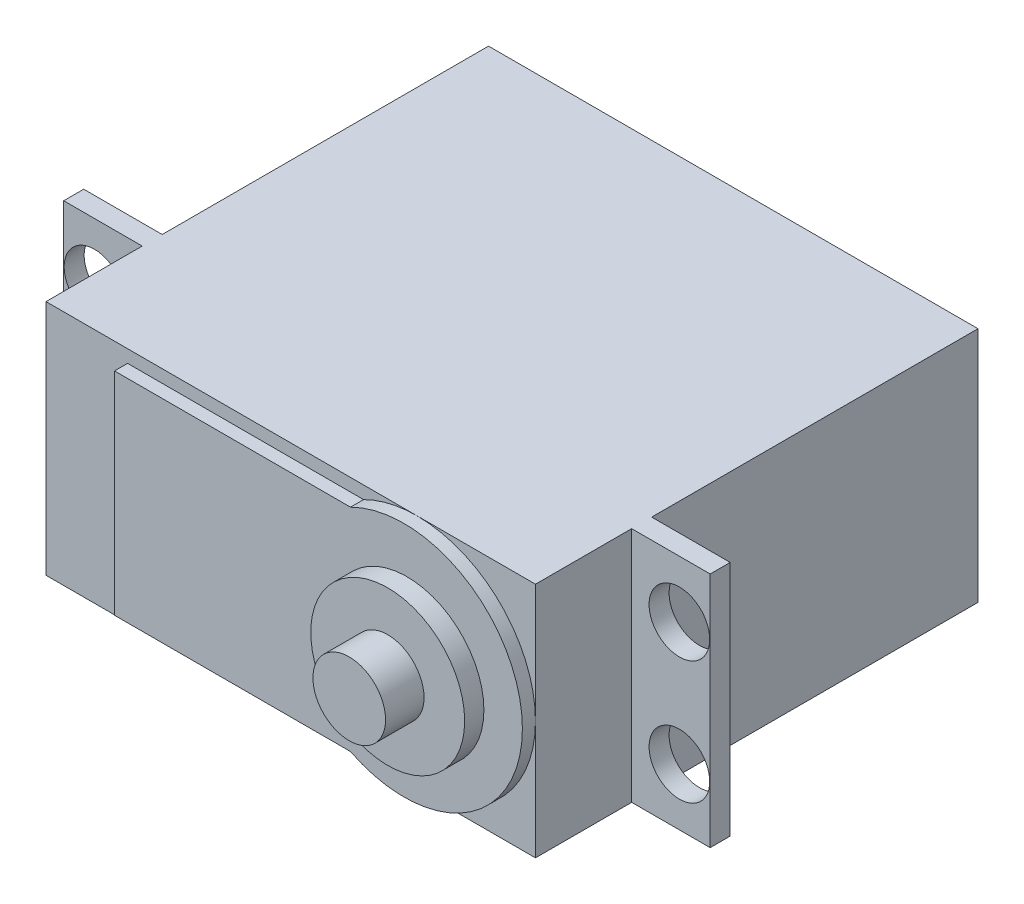
ISO-10303-21;
HEADER;
FILE_DESCRIPTION(('STEP AP214'),'2;1');
FILE_NAME('part.step','',(''),(''),'','','');
FILE_SCHEMA(('AUTOMOTIVE_DESIGN { 1 0 10303 214 1 1 1 1 }'));
ENDSEC;
DATA;
#1=APPLICATION_CONTEXT('core data for automotive mechanical design processes');
#2=APPLICATION_PROTOCOL_DEFINITION('international standard','automotive_design',2000,#1);
#3=PRODUCT_CONTEXT('',#1,'mechanical');
#4=PRODUCT('Part','Part','',(#3));
#5=PRODUCT_RELATED_PRODUCT_CATEGORY('part','',(#4));
#6=PRODUCT_DEFINITION_FORMATION('','',#4);
#7=PRODUCT_DEFINITION_CONTEXT('part definition',#1,'design');
#8=PRODUCT_DEFINITION('design','',#6,#7);
#9=PRODUCT_DEFINITION_SHAPE('','',#8);
#10=(LENGTH_UNIT() NAMED_UNIT(*) SI_UNIT(.MILLI.,.METRE.));
#11=(NAMED_UNIT(*) PLANE_ANGLE_UNIT() SI_UNIT($,.RADIAN.));
#12=(NAMED_UNIT(*) SI_UNIT($,.STERADIAN.) SOLID_ANGLE_UNIT());
#13=UNCERTAINTY_MEASURE_WITH_UNIT(LENGTH_MEASURE(1.E-05),#10,'distance_accuracy_value','');
#14=(GEOMETRIC_REPRESENTATION_CONTEXT(3) GLOBAL_UNCERTAINTY_ASSIGNED_CONTEXT((#13)) GLOBAL_UNIT_ASSIGNED_CONTEXT((#10,
#11,#12)) REPRESENTATION_CONTEXT('',''));
#15=CARTESIAN_POINT('',(0.,0.,0.));
#16=DIRECTION('',(0.,0.,1.));
#17=DIRECTION('',(1.,0.,0.));
#18=AXIS2_PLACEMENT_3D('',#15,#16,#17);
#19=CARTESIAN_POINT('',(0.,0.,36.5125));
#20=DIRECTION('',(0.,0.,1.));
#21=DIRECTION('',(1.,0.,0.));
#22=AXIS2_PLACEMENT_3D('',#19,#20,#21);
#23=PLANE('',#22);
#24=CARTESIAN_POINT('',(-43.1606186472595,-12.9670800765665,36.5125));
#25=DIRECTION('',(0.,0.,1.));
#26=DIRECTION('',(1.,0.,0.));
#27=AXIS2_PLACEMENT_3D('',#24,#25,#26);
#28=CIRCLE('',#27,9.779);
#29=CARTESIAN_POINT('',(-47.5644935816213,-21.6983300765665,36.5125));
#30=VERTEX_POINT('',#29);
#31=CARTESIAN_POINT('',(-43.1606186472595,-22.7460800765665,36.5125));
#32=VERTEX_POINT('',#31);
#33=EDGE_CURVE('E46',#30,#32,#28,.T.);
#34=ORIENTED_EDGE('',*,*,#33,.F.);
#35=DIRECTION('',(-1.,0.,0.));
#36=VECTOR('',#35,1.);
#37=CARTESIAN_POINT('',(0.,-21.6983300765665,36.5125));
#38=LINE('',#37,#36);
#39=CARTESIAN_POINT('',(-67.0366186472595,-21.6983300765665,36.5125));
#40=VERTEX_POINT('',#39);
#41=EDGE_CURVE('E53',#30,#40,#38,.T.);
#42=ORIENTED_EDGE('',*,*,#41,.T.);
#43=DIRECTION('',(0.,1.,0.));
#44=VECTOR('',#43,1.);
#45=CARTESIAN_POINT('',(-67.0366186472595,0.,36.5125));
#46=LINE('',#45,#44);
#47=CARTESIAN_POINT('',(-67.0366186472595,-4.23583007656654,36.5125));
#48=VERTEX_POINT('',#47);
#49=EDGE_CURVE('E58',#40,#48,#46,.T.);
#50=ORIENTED_EDGE('',*,*,#49,.T.);
#51=DIRECTION('',(-1.,0.,0.));
#52=VECTOR('',#51,1.);
#53=CARTESIAN_POINT('',(0.,-4.23583007656653,36.5125));
#54=LINE('',#53,#52);
#55=CARTESIAN_POINT('',(-47.5644935816213,-4.23583007656654,36.5125));
#56=VERTEX_POINT('',#55);
#57=EDGE_CURVE('E183',#56,#48,#54,.T.);
#58=ORIENTED_EDGE('',*,*,#57,.F.);
#59=CARTESIAN_POINT('',(-43.1606186472595,-3.18808007656653,36.5125));
#60=VERTEX_POINT('',#59);
#61=EDGE_CURVE('E194',#60,#56,#28,.T.);
#62=ORIENTED_EDGE('',*,*,#61,.F.);
#63=DIRECTION('',(-1.,0.,0.));
#64=VECTOR('',#63,1.);
#65=CARTESIAN_POINT('',(-73.7676186472595,-3.18808007656653,36.5125));
#66=LINE('',#65,#64);
#67=CARTESIAN_POINT('',(-73.7676186472595,-3.18808007656653,36.5125));
#68=VERTEX_POINT('',#67);
#69=EDGE_CURVE('E213',#60,#68,#66,.T.);
#70=ORIENTED_EDGE('',*,*,#69,.T.);
#71=DIRECTION('',(0.,-1.,0.));
#72=VECTOR('',#71,1.);
#73=CARTESIAN_POINT('',(-73.7676186472595,-3.18808007656653,36.5125));
#74=LINE('',#73,#72);
#75=CARTESIAN_POINT('',(-73.7676186472595,-22.7460800765665,36.5125));
#76=VERTEX_POINT('',#75);
#77=EDGE_CURVE('E201',#68,#76,#74,.T.);
#78=ORIENTED_EDGE('',*,*,#77,.T.);
#79=DIRECTION('',(1.,0.,0.));
#80=VECTOR('',#79,1.);
#81=CARTESIAN_POINT('',(-73.7676186472595,-22.7460800765665,36.5125));
#82=LINE('',#81,#80);
#83=EDGE_CURVE('E206',#76,#32,#82,.T.);
#84=ORIENTED_EDGE('',*,*,#83,.T.);
#85=EDGE_LOOP('',(#34,#42,#50,#58,#62,#70,#78,#84));
#86=FACE_BOUND('',#85,.T.);
#87=ADVANCED_FACE('F35',(#86),#23,.T.);
#88=CARTESIAN_POINT('',(-33.3816186472595,-12.9670800765665,36.5125));
#89=VERTEX_POINT('',#88);
#90=EDGE_CURVE('E11',#32,#89,#28,.T.);
#91=ORIENTED_EDGE('',*,*,#90,.F.);
#92=CARTESIAN_POINT('',(-33.3816186472595,-22.7460800765665,36.5125));
#93=VERTEX_POINT('',#92);
#94=EDGE_CURVE('E204',#32,#93,#82,.T.);
#95=ORIENTED_EDGE('',*,*,#94,.T.);
#96=DIRECTION('',(0.,1.,0.));
#97=VECTOR('',#96,1.);
#98=CARTESIAN_POINT('',(-33.3816186472595,-3.18808007656653,36.5125));
#99=LINE('',#98,#97);
#100=EDGE_CURVE('E210',#93,#89,#99,.T.);
#101=ORIENTED_EDGE('',*,*,#100,.T.);
#102=EDGE_LOOP('',(#91,#95,#101));
#103=FACE_BOUND('',#102,.T.);
#104=ADVANCED_FACE('F408',(#103),#23,.T.);
#105=CARTESIAN_POINT('',(0.,0.,28.575));
#106=DIRECTION('',(0.,0.,1.));
#107=DIRECTION('',(1.,0.,0.));
#108=AXIS2_PLACEMENT_3D('',#105,#106,#107);
#109=PLANE('',#108);
#110=DIRECTION('',(0.,-1.,0.));
#111=VECTOR('',#110,1.);
#112=CARTESIAN_POINT('',(-73.7676186472595,-3.18808007656653,28.575));
#113=LINE('',#112,#111);
#114=CARTESIAN_POINT('',(-73.7676186472595,-3.18808007656653,28.575));
#115=VERTEX_POINT('',#114);
#116=CARTESIAN_POINT('',(-73.7676186472595,-22.7460800765665,28.575));
#117=VERTEX_POINT('',#116);
#118=EDGE_CURVE('E167',#115,#117,#113,.T.);
#119=ORIENTED_EDGE('',*,*,#118,.F.);
#120=DIRECTION('',(-1.,0.,0.));
#121=VECTOR('',#120,1.);
#122=CARTESIAN_POINT('',(-80.2446186472595,-3.18808007656653,28.575));
#123=LINE('',#122,#121);
#124=CARTESIAN_POINT('',(-80.2446186472595,-3.18808007656653,28.575));
#125=VERTEX_POINT('',#124);
#126=EDGE_CURVE('E390',#115,#125,#123,.T.);
#127=ORIENTED_EDGE('',*,*,#126,.T.);
#128=DIRECTION('',(0.,-1.,0.));
#129=VECTOR('',#128,1.);
#130=CARTESIAN_POINT('',(-80.2446186472595,-3.18808007656653,28.575));
#131=LINE('',#130,#129);
#132=CARTESIAN_POINT('',(-80.2446186472595,-22.7460800765665,28.575));
#133=VERTEX_POINT('',#132);
#134=EDGE_CURVE('E278',#125,#133,#131,.T.);
#135=ORIENTED_EDGE('',*,*,#134,.T.);
#136=DIRECTION('',(1.,0.,0.));
#137=VECTOR('',#136,1.);
#138=CARTESIAN_POINT('',(-80.2446186472595,-22.7460800765665,28.575));
#139=LINE('',#138,#137);
#140=EDGE_CURVE('E291',#133,#117,#139,.T.);
#141=ORIENTED_EDGE('',*,*,#140,.T.);
#142=EDGE_LOOP('',(#119,#127,#135,#141));
#143=FACE_BOUND('',#142,.T.);
#144=CARTESIAN_POINT('',(-77.7046186472595,-7.88708007656653,28.575));
#145=DIRECTION('',(0.,0.,1.));
#146=DIRECTION('',(1.,0.,0.));
#147=AXIS2_PLACEMENT_3D('',#144,#145,#146);
#148=CIRCLE('',#147,2.50190000000001);
#149=CARTESIAN_POINT('',(-75.2027186472595,-7.88708007656653,28.575));
#150=VERTEX_POINT('',#149);
#151=EDGE_CURVE('E271',#150,#150,#148,.T.);
#152=ORIENTED_EDGE('',*,*,#151,.F.);
#153=EDGE_LOOP('',(#152));
#154=FACE_BOUND('',#153,.T.);
#155=CARTESIAN_POINT('',(-77.7046186472594,-18.0470800765665,28.575));
#156=DIRECTION('',(0.,0.,1.));
#157=DIRECTION('',(1.,0.,0.));
#158=AXIS2_PLACEMENT_3D('',#155,#156,#157);
#159=CIRCLE('',#158,2.5019);
#160=CARTESIAN_POINT('',(-75.2027186472594,-18.0470800765665,28.575));
#161=VERTEX_POINT('',#160);
#162=EDGE_CURVE('E249',#161,#161,#159,.T.);
#163=ORIENTED_EDGE('',*,*,#162,.F.);
#164=EDGE_LOOP('',(#163));
#165=FACE_BOUND('',#164,.T.);
#166=ADVANCED_FACE('F412',(#143,#154,#165),#109,.T.);
#167=CARTESIAN_POINT('',(-73.7676186472595,-3.18808007656653,26.924));
#168=DIRECTION('',(1.,0.,0.));
#169=DIRECTION('',(0.,0.,-1.));
#170=AXIS2_PLACEMENT_3D('',#167,#168,#169);
#171=PLANE('',#170);
#172=DIRECTION('',(0.,-1.,0.));
#173=VECTOR('',#172,1.);
#174=CARTESIAN_POINT('',(-73.7676186472595,-3.18808007656653,0.));
#175=LINE('',#174,#173);
#176=CARTESIAN_POINT('',(-73.7676186472595,-3.18808007656653,0.));
#177=VERTEX_POINT('',#176);
#178=CARTESIAN_POINT('',(-73.7676186472595,-22.7460800765665,0.));
#179=VERTEX_POINT('',#178);
#180=EDGE_CURVE('E321',#177,#179,#175,.T.);
#181=ORIENTED_EDGE('',*,*,#180,.T.);
#182=DIRECTION('',(0.,0.,-1.));
#183=VECTOR('',#182,1.);
#184=CARTESIAN_POINT('',(-73.7676186472595,-22.7460800765665,26.924));
#185=LINE('',#184,#183);
#186=CARTESIAN_POINT('',(-73.7676186472595,-22.7460800765665,26.924));
#187=VERTEX_POINT('',#186);
#188=EDGE_CURVE('E302',#187,#179,#185,.T.);
#189=ORIENTED_EDGE('',*,*,#188,.F.);
#190=DIRECTION('',(0.,-1.,0.));
#191=VECTOR('',#190,1.);
#192=CARTESIAN_POINT('',(-73.7676186472595,-3.18808007656653,26.924));
#193=LINE('',#192,#191);
#194=CARTESIAN_POINT('',(-73.7676186472595,-3.18808007656653,26.924));
#195=VERTEX_POINT('',#194);
#196=EDGE_CURVE('E306',#195,#187,#193,.T.);
#197=ORIENTED_EDGE('',*,*,#196,.F.);
#198=DIRECTION('',(0.,0.,-1.));
#199=VECTOR('',#198,1.);
#200=CARTESIAN_POINT('',(-73.7676186472595,-3.18808007656653,26.924));
#201=LINE('',#200,#199);
#202=EDGE_CURVE('E295',#195,#177,#201,.T.);
#203=ORIENTED_EDGE('',*,*,#202,.T.);
#204=EDGE_LOOP('',(#181,#189,#197,#203));
#205=FACE_BOUND('',#204,.T.);
#206=ADVANCED_FACE('F37',(#205),#171,.F.);
#207=CARTESIAN_POINT('',(-73.7676186472595,-22.7460800765665,26.924));
#208=DIRECTION('',(0.,1.,0.));
#209=DIRECTION('',(0.,0.,1.));
#210=AXIS2_PLACEMENT_3D('',#207,#208,#209);
#211=PLANE('',#210);
#212=DIRECTION('',(1.,0.,0.));
#213=VECTOR('',#212,1.);
#214=CARTESIAN_POINT('',(-73.7676186472595,-22.7460800765665,0.));
#215=LINE('',#214,#213);
#216=CARTESIAN_POINT('',(-33.3816186472595,-22.7460800765665,0.));
#217=VERTEX_POINT('',#216);
#218=EDGE_CURVE('E338',#179,#217,#215,.T.);
#219=ORIENTED_EDGE('',*,*,#218,.T.);
#220=DIRECTION('',(0.,0.,-1.));
#221=VECTOR('',#220,1.);
#222=CARTESIAN_POINT('',(-33.3816186472595,-22.7460800765665,26.924));
#223=LINE('',#222,#221);
#224=CARTESIAN_POINT('',(-33.3816186472595,-22.7460800765665,26.924));
#225=VERTEX_POINT('',#224);
#226=EDGE_CURVE('E305',#225,#217,#223,.T.);
#227=ORIENTED_EDGE('',*,*,#226,.F.);
#228=DIRECTION('',(1.,0.,0.));
#229=VECTOR('',#228,1.);
#230=CARTESIAN_POINT('',(-80.2446186472595,-22.7460800765665,26.924));
#231=LINE('',#230,#229);
#232=CARTESIAN_POINT('',(-26.9046186472595,-22.7460800765665,26.924));
#233=VERTEX_POINT('',#232);
#234=EDGE_CURVE('E316',#225,#233,#231,.T.);
#235=ORIENTED_EDGE('',*,*,#234,.T.);
#236=DIRECTION('',(0.,0.,-1.));
#237=VECTOR('',#236,1.);
#238=CARTESIAN_POINT('',(-26.9046186472595,-22.7460800765665,28.575));
#239=LINE('',#238,#237);
#240=CARTESIAN_POINT('',(-26.9046186472595,-22.7460800765665,28.575));
#241=VERTEX_POINT('',#240);
#242=EDGE_CURVE('E344',#241,#233,#239,.T.);
#243=ORIENTED_EDGE('',*,*,#242,.F.);
#244=CARTESIAN_POINT('',(-33.3816186472595,-22.7460800765665,28.575));
#245=VERTEX_POINT('',#244);
#246=EDGE_CURVE('E281',#245,#241,#139,.T.);
#247=ORIENTED_EDGE('',*,*,#246,.F.);
#248=DIRECTION('',(0.,0.,-1.));
#249=VECTOR('',#248,1.);
#250=CARTESIAN_POINT('',(-33.3816186472595,-22.7460800765665,36.5125));
#251=LINE('',#250,#249);
#252=EDGE_CURVE('E233',#93,#245,#251,.T.);
#253=ORIENTED_EDGE('',*,*,#252,.F.);
#254=ORIENTED_EDGE('',*,*,#94,.F.);
#255=ORIENTED_EDGE('',*,*,#83,.F.);
#256=DIRECTION('',(0.,0.,-1.));
#257=VECTOR('',#256,1.);
#258=CARTESIAN_POINT('',(-73.7676186472595,-22.7460800765665,36.5125));
#259=LINE('',#258,#257);
#260=EDGE_CURVE('E240',#76,#117,#259,.T.);
#261=ORIENTED_EDGE('',*,*,#260,.T.);
#262=ORIENTED_EDGE('',*,*,#140,.F.);
#263=DIRECTION('',(0.,0.,-1.));
#264=VECTOR('',#263,1.);
#265=CARTESIAN_POINT('',(-80.2446186472595,-22.7460800765665,28.575));
#266=LINE('',#265,#264);
#267=CARTESIAN_POINT('',(-80.2446186472595,-22.7460800765665,26.924));
#268=VERTEX_POINT('',#267);
#269=EDGE_CURVE('E340',#133,#268,#266,.T.);
#270=ORIENTED_EDGE('',*,*,#269,.T.);
#271=EDGE_CURVE('E384',#268,#187,#231,.T.);
#272=ORIENTED_EDGE('',*,*,#271,.T.);
#273=ORIENTED_EDGE('',*,*,#188,.T.);
#274=EDGE_LOOP('',(#219,#227,#235,#243,#247,#253,#254,#255,#261,#262,#270,#272,#273));
#275=FACE_BOUND('',#274,.T.);
#276=ADVANCED_FACE('F400',(#275),#211,.F.);
#277=CARTESIAN_POINT('',(-33.3816186472595,-3.18808007656653,26.924));
#278=DIRECTION('',(-1.,0.,0.));
#279=DIRECTION('',(0.,0.,1.));
#280=AXIS2_PLACEMENT_3D('',#277,#278,#279);
#281=PLANE('',#280);
#282=DIRECTION('',(0.,1.,0.));
#283=VECTOR('',#282,1.);
#284=CARTESIAN_POINT('',(-33.3816186472595,-3.18808007656653,0.));
#285=LINE('',#284,#283);
#286=CARTESIAN_POINT('',(-33.3816186472595,-3.18808007656653,0.));
#287=VERTEX_POINT('',#286);
#288=EDGE_CURVE('E337',#217,#287,#285,.T.);
#289=ORIENTED_EDGE('',*,*,#288,.T.);
#290=DIRECTION('',(0.,0.,-1.));
#291=VECTOR('',#290,1.);
#292=CARTESIAN_POINT('',(-33.3816186472595,-3.18808007656653,26.924));
#293=LINE('',#292,#291);
#294=CARTESIAN_POINT('',(-33.3816186472595,-3.18808007656653,26.924));
#295=VERTEX_POINT('',#294);
#296=EDGE_CURVE('E298',#295,#287,#293,.T.);
#297=ORIENTED_EDGE('',*,*,#296,.F.);
#298=DIRECTION('',(0.,1.,0.));
#299=VECTOR('',#298,1.);
#300=CARTESIAN_POINT('',(-33.3816186472595,-3.18808007656653,26.924));
#301=LINE('',#300,#299);
#302=EDGE_CURVE('E299',#225,#295,#301,.T.);
#303=ORIENTED_EDGE('',*,*,#302,.F.);
#304=ORIENTED_EDGE('',*,*,#226,.T.);
#305=EDGE_LOOP('',(#289,#297,#303,#304));
#306=FACE_BOUND('',#305,.T.);
#307=ADVANCED_FACE('F375',(#306),#281,.F.);
#308=CARTESIAN_POINT('',(-73.7676186472595,-3.18808007656653,26.924));
#309=DIRECTION('',(0.,-1.,0.));
#310=DIRECTION('',(0.,0.,-1.));
#311=AXIS2_PLACEMENT_3D('',#308,#309,#310);
#312=PLANE('',#311);
#313=DIRECTION('',(-1.,0.,0.));
#314=VECTOR('',#313,1.);
#315=CARTESIAN_POINT('',(-73.7676186472595,-3.18808007656653,0.));
#316=LINE('',#315,#314);
#317=EDGE_CURVE('E310',#287,#177,#316,.T.);
#318=ORIENTED_EDGE('',*,*,#317,.T.);
#319=ORIENTED_EDGE('',*,*,#202,.F.);
#320=DIRECTION('',(-1.,0.,0.));
#321=VECTOR('',#320,1.);
#322=CARTESIAN_POINT('',(-80.2446186472595,-3.18808007656653,26.924));
#323=LINE('',#322,#321);
#324=CARTESIAN_POINT('',(-80.2446186472595,-3.18808007656653,26.924));
#325=VERTEX_POINT('',#324);
#326=EDGE_CURVE('E356',#195,#325,#323,.T.);
#327=ORIENTED_EDGE('',*,*,#326,.T.);
#328=DIRECTION('',(0.,0.,-1.));
#329=VECTOR('',#328,1.);
#330=CARTESIAN_POINT('',(-80.2446186472595,-3.18808007656653,28.575));
#331=LINE('',#330,#329);
#332=EDGE_CURVE('E361',#125,#325,#331,.T.);
#333=ORIENTED_EDGE('',*,*,#332,.F.);
#334=ORIENTED_EDGE('',*,*,#126,.F.);
#335=DIRECTION('',(0.,0.,-1.));
#336=VECTOR('',#335,1.);
#337=CARTESIAN_POINT('',(-73.7676186472595,-3.18808007656653,36.5125));
#338=LINE('',#337,#336);
#339=EDGE_CURVE('E217',#68,#115,#338,.T.);
#340=ORIENTED_EDGE('',*,*,#339,.F.);
#341=ORIENTED_EDGE('',*,*,#69,.F.);
#342=CARTESIAN_POINT('',(-33.3816186472595,-3.18808007656653,36.5125));
#343=VERTEX_POINT('',#342);
#344=EDGE_CURVE('E214',#343,#60,#66,.T.);
#345=ORIENTED_EDGE('',*,*,#344,.F.);
#346=DIRECTION('',(0.,0.,-1.));
#347=VECTOR('',#346,1.);
#348=CARTESIAN_POINT('',(-33.3816186472595,-3.18808007656653,36.5125));
#349=LINE('',#348,#347);
#350=CARTESIAN_POINT('',(-33.3816186472595,-3.18808007656653,28.575));
#351=VERTEX_POINT('',#350);
#352=EDGE_CURVE('E228',#343,#351,#349,.T.);
#353=ORIENTED_EDGE('',*,*,#352,.T.);
#354=CARTESIAN_POINT('',(-26.9046186472595,-3.18808007656653,28.575));
#355=VERTEX_POINT('',#354);
#356=EDGE_CURVE('E364',#355,#351,#123,.T.);
#357=ORIENTED_EDGE('',*,*,#356,.F.);
#358=DIRECTION('',(0.,0.,-1.));
#359=VECTOR('',#358,1.);
#360=CARTESIAN_POINT('',(-26.9046186472595,-3.18808007656653,28.575));
#361=LINE('',#360,#359);
#362=CARTESIAN_POINT('',(-26.9046186472595,-3.18808007656653,26.924));
#363=VERTEX_POINT('',#362);
#364=EDGE_CURVE('E350',#355,#363,#361,.T.);
#365=ORIENTED_EDGE('',*,*,#364,.T.);
#366=EDGE_CURVE('E282',#363,#295,#323,.T.);
#367=ORIENTED_EDGE('',*,*,#366,.T.);
#368=ORIENTED_EDGE('',*,*,#296,.T.);
#369=EDGE_LOOP('',(#318,#319,#327,#333,#334,#340,#341,#345,#353,#357,#365,#367,#368));
#370=FACE_BOUND('',#369,.T.);
#371=ADVANCED_FACE('F368',(#370),#312,.F.);
#372=CARTESIAN_POINT('',(0.,0.,0.));
#373=DIRECTION('',(0.,0.,1.));
#374=DIRECTION('',(1.,0.,0.));
#375=AXIS2_PLACEMENT_3D('',#372,#373,#374);
#376=PLANE('',#375);
#377=ORIENTED_EDGE('',*,*,#180,.F.);
#378=ORIENTED_EDGE('',*,*,#317,.F.);
#379=ORIENTED_EDGE('',*,*,#288,.F.);
#380=ORIENTED_EDGE('',*,*,#218,.F.);
#381=EDGE_LOOP('',(#377,#378,#379,#380));
#382=FACE_BOUND('',#381,.T.);
#383=ADVANCED_FACE('F377',(#382),#376,.F.);
#384=CARTESIAN_POINT('',(0.,0.,26.924));
#385=DIRECTION('',(0.,0.,1.));
#386=DIRECTION('',(1.,0.,0.));
#387=AXIS2_PLACEMENT_3D('',#384,#385,#386);
#388=PLANE('',#387);
#389=CARTESIAN_POINT('',(-77.7046186472594,-18.0470800765665,26.924));
#390=DIRECTION('',(0.,0.,1.));
#391=DIRECTION('',(1.,0.,0.));
#392=AXIS2_PLACEMENT_3D('',#389,#390,#391);
#393=CIRCLE('',#392,2.5019);
#394=CARTESIAN_POINT('',(-75.2027186472594,-18.0470800765665,26.924));
#395=VERTEX_POINT('',#394);
#396=EDGE_CURVE('E253',#395,#395,#393,.T.);
#397=ORIENTED_EDGE('',*,*,#396,.T.);
#398=EDGE_LOOP('',(#397));
#399=FACE_BOUND('',#398,.T.);
#400=CARTESIAN_POINT('',(-77.7046186472595,-7.88708007656653,26.924));
#401=DIRECTION('',(0.,0.,1.));
#402=DIRECTION('',(1.,0.,0.));
#403=AXIS2_PLACEMENT_3D('',#400,#401,#402);
#404=CIRCLE('',#403,2.50190000000001);
#405=CARTESIAN_POINT('',(-75.2027186472595,-7.88708007656653,26.924));
#406=VERTEX_POINT('',#405);
#407=EDGE_CURVE('E274',#406,#406,#404,.T.);
#408=ORIENTED_EDGE('',*,*,#407,.T.);
#409=EDGE_LOOP('',(#408));
#410=FACE_BOUND('',#409,.T.);
#411=ORIENTED_EDGE('',*,*,#326,.F.);
#412=ORIENTED_EDGE('',*,*,#196,.T.);
#413=ORIENTED_EDGE('',*,*,#271,.F.);
#414=DIRECTION('',(0.,-1.,0.));
#415=VECTOR('',#414,1.);
#416=CARTESIAN_POINT('',(-80.2446186472595,-3.18808007656653,26.924));
#417=LINE('',#416,#415);
#418=EDGE_CURVE('E277',#325,#268,#417,.T.);
#419=ORIENTED_EDGE('',*,*,#418,.F.);
#420=EDGE_LOOP('',(#411,#412,#413,#419));
#421=FACE_BOUND('',#420,.T.);
#422=ADVANCED_FACE('F382',(#399,#410,#421),#388,.F.);
#423=CARTESIAN_POINT('',(-29.4446186472594,-18.0470800765665,26.924));
#424=DIRECTION('',(0.,0.,1.));
#425=DIRECTION('',(1.,0.,0.));
#426=AXIS2_PLACEMENT_3D('',#423,#424,#425);
#427=CIRCLE('',#426,2.5019);
#428=CARTESIAN_POINT('',(-26.9427186472594,-18.0470800765665,26.924));
#429=VERTEX_POINT('',#428);
#430=EDGE_CURVE('E262',#429,#429,#427,.T.);
#431=ORIENTED_EDGE('',*,*,#430,.T.);
#432=EDGE_LOOP('',(#431));
#433=FACE_BOUND('',#432,.T.);
#434=CARTESIAN_POINT('',(-29.4446186472595,-7.88708007656653,26.924));
#435=DIRECTION('',(0.,0.,1.));
#436=DIRECTION('',(1.,0.,0.));
#437=AXIS2_PLACEMENT_3D('',#434,#435,#436);
#438=CIRCLE('',#437,2.50190000000001);
#439=CARTESIAN_POINT('',(-26.9427186472595,-7.88708007656653,26.924));
#440=VERTEX_POINT('',#439);
#441=EDGE_CURVE('E268',#440,#440,#438,.T.);
#442=ORIENTED_EDGE('',*,*,#441,.T.);
#443=EDGE_LOOP('',(#442));
#444=FACE_BOUND('',#443,.T.);
#445=ORIENTED_EDGE('',*,*,#234,.F.);
#446=ORIENTED_EDGE('',*,*,#302,.T.);
#447=ORIENTED_EDGE('',*,*,#366,.F.);
#448=DIRECTION('',(0.,1.,0.));
#449=VECTOR('',#448,1.);
#450=CARTESIAN_POINT('',(-26.9046186472595,-3.18808007656653,26.924));
#451=LINE('',#450,#449);
#452=EDGE_CURVE('E360',#233,#363,#451,.T.);
#453=ORIENTED_EDGE('',*,*,#452,.F.);
#454=EDGE_LOOP('',(#445,#446,#447,#453));
#455=FACE_BOUND('',#454,.T.);
#456=ADVANCED_FACE('F374',(#433,#444,#455),#388,.F.);
#457=CARTESIAN_POINT('',(-80.2446186472595,-3.18808007656653,28.575));
#458=DIRECTION('',(1.,0.,0.));
#459=DIRECTION('',(0.,0.,-1.));
#460=AXIS2_PLACEMENT_3D('',#457,#458,#459);
#461=PLANE('',#460);
#462=ORIENTED_EDGE('',*,*,#418,.T.);
#463=ORIENTED_EDGE('',*,*,#269,.F.);
#464=ORIENTED_EDGE('',*,*,#134,.F.);
#465=ORIENTED_EDGE('',*,*,#332,.T.);
#466=EDGE_LOOP('',(#462,#463,#464,#465));
#467=FACE_BOUND('',#466,.T.);
#468=ADVANCED_FACE('F416',(#467),#461,.F.);
#469=CARTESIAN_POINT('',(-26.9046186472595,-3.18808007656653,28.575));
#470=DIRECTION('',(-1.,0.,0.));
#471=DIRECTION('',(0.,0.,1.));
#472=AXIS2_PLACEMENT_3D('',#469,#470,#471);
#473=PLANE('',#472);
#474=ORIENTED_EDGE('',*,*,#452,.T.);
#475=ORIENTED_EDGE('',*,*,#364,.F.);
#476=DIRECTION('',(0.,1.,0.));
#477=VECTOR('',#476,1.);
#478=CARTESIAN_POINT('',(-26.9046186472595,-3.18808007656653,28.575));
#479=LINE('',#478,#477);
#480=EDGE_CURVE('E285',#241,#355,#479,.T.);
#481=ORIENTED_EDGE('',*,*,#480,.F.);
#482=ORIENTED_EDGE('',*,*,#242,.T.);
#483=EDGE_LOOP('',(#474,#475,#481,#482));
#484=FACE_BOUND('',#483,.T.);
#485=ADVANCED_FACE('F399',(#484),#473,.F.);
#486=DIRECTION('',(0.,1.,0.));
#487=VECTOR('',#486,1.);
#488=CARTESIAN_POINT('',(-33.3816186472595,-3.18808007656653,28.575));
#489=LINE('',#488,#487);
#490=EDGE_CURVE('E205',#245,#351,#489,.T.);
#491=ORIENTED_EDGE('',*,*,#490,.F.);
#492=ORIENTED_EDGE('',*,*,#246,.T.);
#493=ORIENTED_EDGE('',*,*,#480,.T.);
#494=ORIENTED_EDGE('',*,*,#356,.T.);
#495=EDGE_LOOP('',(#491,#492,#493,#494));
#496=FACE_BOUND('',#495,.T.);
#497=CARTESIAN_POINT('',(-29.4446186472594,-18.0470800765665,28.575));
#498=DIRECTION('',(0.,0.,1.));
#499=DIRECTION('',(1.,0.,0.));
#500=AXIS2_PLACEMENT_3D('',#497,#498,#499);
#501=CIRCLE('',#500,2.5019);
#502=CARTESIAN_POINT('',(-26.9427186472594,-18.0470800765665,28.575));
#503=VERTEX_POINT('',#502);
#504=EDGE_CURVE('E257',#503,#503,#501,.T.);
#505=ORIENTED_EDGE('',*,*,#504,.F.);
#506=EDGE_LOOP('',(#505));
#507=FACE_BOUND('',#506,.T.);
#508=CARTESIAN_POINT('',(-29.4446186472595,-7.88708007656653,28.575));
#509=DIRECTION('',(0.,0.,1.));
#510=DIRECTION('',(1.,0.,0.));
#511=AXIS2_PLACEMENT_3D('',#508,#509,#510);
#512=CIRCLE('',#511,2.50190000000001);
#513=CARTESIAN_POINT('',(-26.9427186472595,-7.88708007656653,28.575));
#514=VERTEX_POINT('',#513);
#515=EDGE_CURVE('E265',#514,#514,#512,.T.);
#516=ORIENTED_EDGE('',*,*,#515,.F.);
#517=EDGE_LOOP('',(#516));
#518=FACE_BOUND('',#517,.T.);
#519=ADVANCED_FACE('F395',(#496,#507,#518),#109,.T.);
#520=CARTESIAN_POINT('',(-77.7046186472595,-7.88708007656653,25.4));
#521=DIRECTION('',(0.,0.,1.));
#522=DIRECTION('',(1.,0.,0.));
#523=AXIS2_PLACEMENT_3D('',#520,#521,#522);
#524=CYLINDRICAL_SURFACE('',#523,2.50190000000001);
#525=ORIENTED_EDGE('',*,*,#151,.T.);
#526=EDGE_LOOP('',(#525));
#527=FACE_BOUND('',#526,.T.);
#528=ORIENTED_EDGE('',*,*,#407,.F.);
#529=EDGE_LOOP('',(#528));
#530=FACE_BOUND('',#529,.T.);
#531=ADVANCED_FACE('F620',(#527,#530),#524,.F.);
#532=CARTESIAN_POINT('',(-29.4446186472595,-7.88708007656653,25.4));
#533=DIRECTION('',(0.,0.,1.));
#534=DIRECTION('',(1.,0.,0.));
#535=AXIS2_PLACEMENT_3D('',#532,#533,#534);
#536=CYLINDRICAL_SURFACE('',#535,2.50190000000001);
#537=ORIENTED_EDGE('',*,*,#515,.T.);
#538=EDGE_LOOP('',(#537));
#539=FACE_BOUND('',#538,.T.);
#540=ORIENTED_EDGE('',*,*,#441,.F.);
#541=EDGE_LOOP('',(#540));
#542=FACE_BOUND('',#541,.T.);
#543=ADVANCED_FACE('F611',(#539,#542),#536,.F.);
#544=CARTESIAN_POINT('',(-29.4446186472594,-18.0470800765665,25.4));
#545=DIRECTION('',(0.,0.,1.));
#546=DIRECTION('',(1.,0.,0.));
#547=AXIS2_PLACEMENT_3D('',#544,#545,#546);
#548=CYLINDRICAL_SURFACE('',#547,2.5019);
#549=ORIENTED_EDGE('',*,*,#504,.T.);
#550=EDGE_LOOP('',(#549));
#551=FACE_BOUND('',#550,.T.);
#552=ORIENTED_EDGE('',*,*,#430,.F.);
#553=EDGE_LOOP('',(#552));
#554=FACE_BOUND('',#553,.T.);
#555=ADVANCED_FACE('F603',(#551,#554),#548,.F.);
#556=CARTESIAN_POINT('',(-77.7046186472594,-18.0470800765665,25.4));
#557=DIRECTION('',(0.,0.,1.));
#558=DIRECTION('',(1.,0.,0.));
#559=AXIS2_PLACEMENT_3D('',#556,#557,#558);
#560=CYLINDRICAL_SURFACE('',#559,2.5019);
#561=ORIENTED_EDGE('',*,*,#162,.T.);
#562=EDGE_LOOP('',(#561));
#563=FACE_BOUND('',#562,.T.);
#564=ORIENTED_EDGE('',*,*,#396,.F.);
#565=EDGE_LOOP('',(#564));
#566=FACE_BOUND('',#565,.T.);
#567=ADVANCED_FACE('F566',(#563,#566),#560,.F.);
#568=CARTESIAN_POINT('',(-73.7676186472595,-3.18808007656653,36.5125));
#569=DIRECTION('',(1.,0.,0.));
#570=DIRECTION('',(0.,0.,-1.));
#571=AXIS2_PLACEMENT_3D('',#568,#569,#570);
#572=PLANE('',#571);
#573=ORIENTED_EDGE('',*,*,#118,.T.);
#574=ORIENTED_EDGE('',*,*,#260,.F.);
#575=ORIENTED_EDGE('',*,*,#77,.F.);
#576=ORIENTED_EDGE('',*,*,#339,.T.);
#577=EDGE_LOOP('',(#573,#574,#575,#576));
#578=FACE_BOUND('',#577,.T.);
#579=ADVANCED_FACE('F411',(#578),#572,.F.);
#580=CARTESIAN_POINT('',(-33.3816186472595,-3.18808007656653,36.5125));
#581=DIRECTION('',(-1.,0.,0.));
#582=DIRECTION('',(0.,0.,1.));
#583=AXIS2_PLACEMENT_3D('',#580,#581,#582);
#584=PLANE('',#583);
#585=ORIENTED_EDGE('',*,*,#490,.T.);
#586=ORIENTED_EDGE('',*,*,#352,.F.);
#587=EDGE_CURVE('E209',#89,#343,#99,.T.);
#588=ORIENTED_EDGE('',*,*,#587,.F.);
#589=ORIENTED_EDGE('',*,*,#100,.F.);
#590=ORIENTED_EDGE('',*,*,#252,.T.);
#591=EDGE_LOOP('',(#585,#586,#588,#589,#590));
#592=FACE_BOUND('',#591,.T.);
#593=ADVANCED_FACE('F405',(#592),#584,.F.);
#594=EDGE_CURVE('E44',#89,#60,#28,.T.);
#595=ORIENTED_EDGE('',*,*,#594,.F.);
#596=ORIENTED_EDGE('',*,*,#587,.T.);
#597=ORIENTED_EDGE('',*,*,#344,.T.);
#598=EDGE_LOOP('',(#595,#596,#597));
#599=FACE_BOUND('',#598,.T.);
#600=ADVANCED_FACE('F429',(#599),#23,.T.);
#601=CARTESIAN_POINT('',(0.,-21.6983300765665,37.592));
#602=DIRECTION('',(0.,-1.,0.));
#603=DIRECTION('',(1.,0.,0.));
#604=AXIS2_PLACEMENT_3D('',#601,#602,#603);
#605=PLANE('',#604);
#606=ORIENTED_EDGE('',*,*,#41,.F.);
#607=DIRECTION('',(0.,0.,-1.));
#608=VECTOR('',#607,1.);
#609=CARTESIAN_POINT('',(-47.5644935816213,-21.6983300765665,37.592));
#610=LINE('',#609,#608);
#611=CARTESIAN_POINT('',(-47.5644935816213,-21.6983300765665,37.592));
#612=VERTEX_POINT('',#611);
#613=EDGE_CURVE('E159',#612,#30,#610,.T.);
#614=ORIENTED_EDGE('',*,*,#613,.F.);
#615=DIRECTION('',(-1.,0.,0.));
#616=VECTOR('',#615,1.);
#617=CARTESIAN_POINT('',(0.,-21.6983300765665,37.592));
#618=LINE('',#617,#616);
#619=CARTESIAN_POINT('',(-67.0366186472595,-21.6983300765665,37.592));
#620=VERTEX_POINT('',#619);
#621=EDGE_CURVE('E163',#612,#620,#618,.T.);
#622=ORIENTED_EDGE('',*,*,#621,.T.);
#623=DIRECTION('',(0.,0.,-1.));
#624=VECTOR('',#623,1.);
#625=CARTESIAN_POINT('',(-67.0366186472595,-21.6983300765665,37.592));
#626=LINE('',#625,#624);
#627=EDGE_CURVE('E191',#620,#40,#626,.T.);
#628=ORIENTED_EDGE('',*,*,#627,.T.);
#629=EDGE_LOOP('',(#606,#614,#622,#628));
#630=FACE_BOUND('',#629,.T.);
#631=ADVANCED_FACE('F161',(#630),#605,.T.);
#632=CARTESIAN_POINT('',(-43.1606186472595,-12.9670800765665,37.592));
#633=DIRECTION('',(0.,0.,-1.));
#634=DIRECTION('',(-1.,0.,0.));
#635=AXIS2_PLACEMENT_3D('',#632,#633,#634);
#636=CYLINDRICAL_SURFACE('',#635,9.779);
#637=ORIENTED_EDGE('',*,*,#33,.T.);
#638=ORIENTED_EDGE('',*,*,#90,.T.);
#639=ORIENTED_EDGE('',*,*,#594,.T.);
#640=ORIENTED_EDGE('',*,*,#61,.T.);
#641=DIRECTION('',(0.,0.,-1.));
#642=VECTOR('',#641,1.);
#643=CARTESIAN_POINT('',(-47.5644935816213,-4.23583007656654,37.592));
#644=LINE('',#643,#642);
#645=CARTESIAN_POINT('',(-47.5644935816213,-4.23583007656654,37.592));
#646=VERTEX_POINT('',#645);
#647=EDGE_CURVE('E168',#646,#56,#644,.T.);
#648=ORIENTED_EDGE('',*,*,#647,.F.);
#649=CARTESIAN_POINT('',(-43.1606186472595,-12.9670800765665,37.592));
#650=DIRECTION('',(0.,0.,1.));
#651=DIRECTION('',(1.,0.,0.));
#652=AXIS2_PLACEMENT_3D('',#649,#650,#651);
#653=CIRCLE('',#652,9.779);
#654=EDGE_CURVE('E171',#612,#646,#653,.T.);
#655=ORIENTED_EDGE('',*,*,#654,.F.);
#656=ORIENTED_EDGE('',*,*,#613,.T.);
#657=EDGE_LOOP('',(#637,#638,#639,#640,#648,#655,#656));
#658=FACE_BOUND('',#657,.T.);
#659=ADVANCED_FACE('F172',(#658),#636,.T.);
#660=CARTESIAN_POINT('',(0.,-4.23583007656653,37.592));
#661=DIRECTION('',(0.,-1.,0.));
#662=DIRECTION('',(1.,0.,0.));
#663=AXIS2_PLACEMENT_3D('',#660,#661,#662);
#664=PLANE('',#663);
#665=ORIENTED_EDGE('',*,*,#57,.T.);
#666=DIRECTION('',(0.,0.,-1.));
#667=VECTOR('',#666,1.);
#668=CARTESIAN_POINT('',(-67.0366186472595,-4.23583007656654,37.592));
#669=LINE('',#668,#667);
#670=CARTESIAN_POINT('',(-67.0366186472595,-4.23583007656654,37.592));
#671=VERTEX_POINT('',#670);
#672=EDGE_CURVE('E198',#671,#48,#669,.T.);
#673=ORIENTED_EDGE('',*,*,#672,.F.);
#674=DIRECTION('',(-1.,0.,0.));
#675=VECTOR('',#674,1.);
#676=CARTESIAN_POINT('',(0.,-4.23583007656653,37.592));
#677=LINE('',#676,#675);
#678=EDGE_CURVE('E177',#646,#671,#677,.T.);
#679=ORIENTED_EDGE('',*,*,#678,.F.);
#680=ORIENTED_EDGE('',*,*,#647,.T.);
#681=EDGE_LOOP('',(#665,#673,#679,#680));
#682=FACE_BOUND('',#681,.T.);
#683=ADVANCED_FACE('F442',(#682),#664,.F.);
#684=CARTESIAN_POINT('',(-67.0366186472595,0.,37.592));
#685=DIRECTION('',(-1.,0.,0.));
#686=DIRECTION('',(0.,0.,1.));
#687=AXIS2_PLACEMENT_3D('',#684,#685,#686);
#688=PLANE('',#687);
#689=ORIENTED_EDGE('',*,*,#49,.F.);
#690=ORIENTED_EDGE('',*,*,#627,.F.);
#691=DIRECTION('',(0.,1.,0.));
#692=VECTOR('',#691,1.);
#693=CARTESIAN_POINT('',(-67.0366186472595,0.,37.592));
#694=LINE('',#693,#692);
#695=EDGE_CURVE('E181',#620,#671,#694,.T.);
#696=ORIENTED_EDGE('',*,*,#695,.T.);
#697=ORIENTED_EDGE('',*,*,#672,.T.);
#698=EDGE_LOOP('',(#689,#690,#696,#697));
#699=FACE_BOUND('',#698,.T.);
#700=ADVANCED_FACE('F445',(#699),#688,.T.);
#701=CARTESIAN_POINT('',(0.,0.,37.592));
#702=DIRECTION('',(0.,0.,1.));
#703=DIRECTION('',(1.,0.,0.));
#704=AXIS2_PLACEMENT_3D('',#701,#702,#703);
#705=PLANE('',#704);
#706=CARTESIAN_POINT('',(-42.9066186472595,-13.2210800765665,37.592));
#707=DIRECTION('',(0.,0.,1.));
#708=DIRECTION('',(1.,0.,0.));
#709=AXIS2_PLACEMENT_3D('',#706,#707,#708);
#710=CIRCLE('',#709,6.35);
#711=CARTESIAN_POINT('',(-36.5566186472595,-13.2210800765665,37.592));
#712=VERTEX_POINT('',#711);
#713=EDGE_CURVE('E186',#712,#712,#710,.T.);
#714=ORIENTED_EDGE('',*,*,#713,.F.);
#715=EDGE_LOOP('',(#714));
#716=FACE_BOUND('',#715,.T.);
#717=ORIENTED_EDGE('',*,*,#621,.F.);
#718=ORIENTED_EDGE('',*,*,#654,.T.);
#719=ORIENTED_EDGE('',*,*,#678,.T.);
#720=ORIENTED_EDGE('',*,*,#695,.F.);
#721=EDGE_LOOP('',(#717,#718,#719,#720));
#722=FACE_BOUND('',#721,.T.);
#723=ADVANCED_FACE('F179',(#716,#722),#705,.T.);
#724=CARTESIAN_POINT('',(-42.9066186472595,-13.2210800765665,39.1795));
#725=DIRECTION('',(0.,0.,-1.));
#726=DIRECTION('',(-1.,0.,0.));
#727=AXIS2_PLACEMENT_3D('',#724,#725,#726);
#728=CYLINDRICAL_SURFACE('',#727,6.35);
#729=CARTESIAN_POINT('',(-42.9066186472595,-13.2210800765665,39.1795));
#730=DIRECTION('',(0.,0.,1.));
#731=DIRECTION('',(1.,0.,0.));
#732=AXIS2_PLACEMENT_3D('',#729,#730,#731);
#733=CIRCLE('',#732,6.35);
#734=CARTESIAN_POINT('',(-36.5566186472595,-13.2210800765665,39.1795));
#735=VERTEX_POINT('',#734);
#736=EDGE_CURVE('E192',#735,#735,#733,.T.);
#737=ORIENTED_EDGE('',*,*,#736,.F.);
#738=EDGE_LOOP('',(#737));
#739=FACE_BOUND('',#738,.T.);
#740=ORIENTED_EDGE('',*,*,#713,.T.);
#741=EDGE_LOOP('',(#740));
#742=FACE_BOUND('',#741,.T.);
#743=ADVANCED_FACE('F452',(#739,#742),#728,.T.);
#744=CARTESIAN_POINT('',(-42.9066186472595,-13.2210800765665,39.1795));
#745=DIRECTION('',(0.,0.,1.));
#746=DIRECTION('',(1.,0.,0.));
#747=AXIS2_PLACEMENT_3D('',#744,#745,#746);
#748=PLANE('',#747);
#749=CARTESIAN_POINT('',(-42.9066186472595,-13.2210800765665,39.1795));
#750=DIRECTION('',(0.,0.,1.));
#751=DIRECTION('',(1.,0.,0.));
#752=AXIS2_PLACEMENT_3D('',#749,#750,#751);
#753=CIRCLE('',#752,2.9972);
#754=CARTESIAN_POINT('',(-39.9094186472595,-13.2210800765665,39.1795));
#755=VERTEX_POINT('',#754);
#756=EDGE_CURVE('E522',#755,#755,#753,.T.);
#757=ORIENTED_EDGE('',*,*,#756,.F.);
#758=EDGE_LOOP('',(#757));
#759=FACE_BOUND('',#758,.T.);
#760=ORIENTED_EDGE('',*,*,#736,.T.);
#761=EDGE_LOOP('',(#760));
#762=FACE_BOUND('',#761,.T.);
#763=ADVANCED_FACE('F486',(#759,#762),#748,.T.);
#764=CARTESIAN_POINT('',(-42.9066186472595,-13.2210800765665,42.3545));
#765=DIRECTION('',(0.,0.,-1.));
#766=DIRECTION('',(-1.,0.,0.));
#767=AXIS2_PLACEMENT_3D('',#764,#765,#766);
#768=CYLINDRICAL_SURFACE('',#767,2.9972);
#769=CARTESIAN_POINT('',(-42.9066186472595,-13.2210800765665,42.3545));
#770=DIRECTION('',(0.,0.,1.));
#771=DIRECTION('',(1.,0.,0.));
#772=AXIS2_PLACEMENT_3D('',#769,#770,#771);
#773=CIRCLE('',#772,2.9972);
#774=CARTESIAN_POINT('',(-39.9094186472595,-13.2210800765665,42.3545));
#775=VERTEX_POINT('',#774);
#776=EDGE_CURVE('E521',#775,#775,#773,.T.);
#777=ORIENTED_EDGE('',*,*,#776,.F.);
#778=EDGE_LOOP('',(#777));
#779=FACE_BOUND('',#778,.T.);
#780=ORIENTED_EDGE('',*,*,#756,.T.);
#781=EDGE_LOOP('',(#780));
#782=FACE_BOUND('',#781,.T.);
#783=ADVANCED_FACE('F495',(#779,#782),#768,.T.);
#784=CARTESIAN_POINT('',(-42.9066186472595,-13.2210800765665,42.3545));
#785=DIRECTION('',(0.,0.,1.));
#786=DIRECTION('',(1.,0.,0.));
#787=AXIS2_PLACEMENT_3D('',#784,#785,#786);
#788=PLANE('',#787);
#789=ORIENTED_EDGE('',*,*,#776,.T.);
#790=EDGE_LOOP('',(#789));
#791=FACE_BOUND('',#790,.T.);
#792=ADVANCED_FACE('F505',(#791),#788,.T.);
#793=CLOSED_SHELL('',(#87,#104,#166,#206,#276,#307,#371,#383,#422,#456,#468,#485,#519,#531,#543,
#555,#567,#579,#593,#600,#631,#659,#683,#700,#723,#743,#763,#783,#792));
#794=MANIFOLD_SOLID_BREP('B2',#793);
#795=ADVANCED_BREP_SHAPE_REPRESENTATION('',(#18,#794),#14);
#796=SHAPE_DEFINITION_REPRESENTATION(#9,#795);
ENDSEC;
END-ISO-10303-21;
